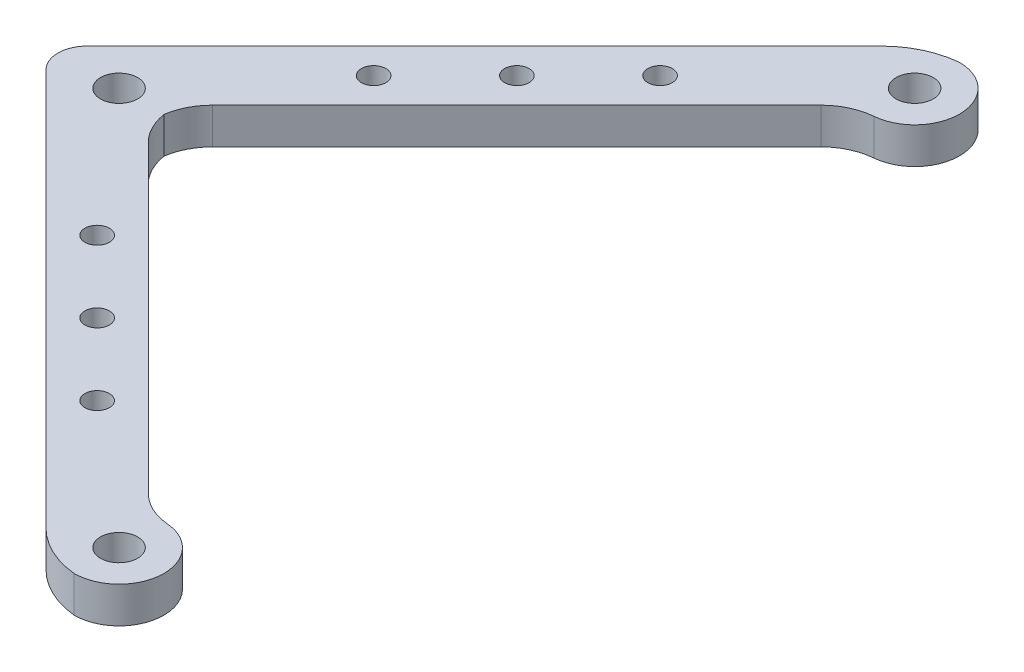
ISO-10303-21;
HEADER;
FILE_DESCRIPTION(('STEP AP214'),'2;1');
FILE_NAME('part.step','',(''),(''),'','','');
FILE_SCHEMA(('AUTOMOTIVE_DESIGN { 1 0 10303 214 1 1 1 1 }'));
ENDSEC;
DATA;
#1=APPLICATION_CONTEXT('core data for automotive mechanical design processes');
#2=APPLICATION_PROTOCOL_DEFINITION('international standard','automotive_design',2000,#1);
#3=PRODUCT_CONTEXT('',#1,'mechanical');
#4=PRODUCT('Part','Part','',(#3));
#5=PRODUCT_RELATED_PRODUCT_CATEGORY('part','',(#4));
#6=PRODUCT_DEFINITION_FORMATION('','',#4);
#7=PRODUCT_DEFINITION_CONTEXT('part definition',#1,'design');
#8=PRODUCT_DEFINITION('design','',#6,#7);
#9=PRODUCT_DEFINITION_SHAPE('','',#8);
#10=(LENGTH_UNIT() NAMED_UNIT(*) SI_UNIT(.MILLI.,.METRE.));
#11=(NAMED_UNIT(*) PLANE_ANGLE_UNIT() SI_UNIT($,.RADIAN.));
#12=(NAMED_UNIT(*) SI_UNIT($,.STERADIAN.) SOLID_ANGLE_UNIT());
#13=UNCERTAINTY_MEASURE_WITH_UNIT(LENGTH_MEASURE(1.E-05),#10,'distance_accuracy_value','');
#14=(GEOMETRIC_REPRESENTATION_CONTEXT(3) GLOBAL_UNCERTAINTY_ASSIGNED_CONTEXT((#13)) GLOBAL_UNIT_ASSIGNED_CONTEXT((#10,
#11,#12)) REPRESENTATION_CONTEXT('',''));
#15=CARTESIAN_POINT('',(0.,0.,0.));
#16=DIRECTION('',(0.,0.,1.));
#17=DIRECTION('',(1.,0.,0.));
#18=AXIS2_PLACEMENT_3D('',#15,#16,#17);
#19=CARTESIAN_POINT('',(0.,6.35,64.7165690571304));
#20=DIRECTION('',(-0.707103580398965,0.,0.707109981959642));
#21=DIRECTION('',(0.707109981959642,0.,0.707103580398965));
#22=AXIS2_PLACEMENT_3D('',#19,#20,#21);
#23=PLANE('',#22);
#24=DIRECTION('',(-0.707109981959642,0.,-0.707103580398965));
#25=VECTOR('',#24,1.);
#26=CARTESIAN_POINT('',(0.,0.,64.7165690571304));
#27=LINE('',#26,#25);
#28=CARTESIAN_POINT('',(-5.65110143879546,0.,59.0655187785076));
#29=VERTEX_POINT('',#28);
#30=CARTESIAN_POINT('',(-59.0654086414636,0.,5.65169514266398));
#31=VERTEX_POINT('',#30);
#32=EDGE_CURVE('E168',#29,#31,#27,.T.);
#33=ORIENTED_EDGE('',*,*,#32,.T.);
#34=DIRECTION('',(0.,1.,0.));
#35=VECTOR('',#34,1.);
#36=CARTESIAN_POINT('',(-59.0654086414636,6.35,5.65169514266398));
#37=LINE('',#36,#35);
#38=CARTESIAN_POINT('',(-59.0654086414636,6.35,5.65169514266398));
#39=VERTEX_POINT('',#38);
#40=EDGE_CURVE('E199',#31,#39,#37,.T.);
#41=ORIENTED_EDGE('',*,*,#40,.T.);
#42=DIRECTION('',(-0.707109981959642,0.,-0.707103580398965));
#43=VECTOR('',#42,1.);
#44=CARTESIAN_POINT('',(0.,6.35,64.7165690571304));
#45=LINE('',#44,#43);
#46=CARTESIAN_POINT('',(-5.65110143879546,6.35,59.0655187785076));
#47=VERTEX_POINT('',#46);
#48=EDGE_CURVE('E172',#47,#39,#45,.T.);
#49=ORIENTED_EDGE('',*,*,#48,.F.);
#50=DIRECTION('',(0.,1.,0.));
#51=VECTOR('',#50,1.);
#52=CARTESIAN_POINT('',(-5.65110143879546,6.35,59.0655187785076));
#53=LINE('',#52,#51);
#54=EDGE_CURVE('E196',#47,#29,#53,.F.);
#55=ORIENTED_EDGE('',*,*,#54,.T.);
#56=EDGE_LOOP('',(#33,#41,#49,#55));
#57=FACE_BOUND('',#56,.T.);
#58=ADVANCED_FACE('F38',(#57),#23,.F.);
#59=CARTESIAN_POINT('',(-82.6777484926492,6.35,0.));
#60=DIRECTION('',(0.707103580398965,0.,-0.707109981959641));
#61=DIRECTION('',(-0.707109981959641,0.,-0.707103580398965));
#62=AXIS2_PLACEMENT_3D('',#59,#60,#61);
#63=PLANE('',#62);
#64=DIRECTION('',(0.707109981959641,0.,0.707103580398965));
#65=VECTOR('',#64,1.);
#66=CARTESIAN_POINT('',(-82.6777484926492,6.35,0.));
#67=LINE('',#66,#65);
#68=CARTESIAN_POINT('',(-79.0855972640716,6.35,3.59211870835497));
#69=VERTEX_POINT('',#68);
#70=CARTESIAN_POINT('',(-9.34982610925561,6.35,73.3272585359634));
#71=VERTEX_POINT('',#70);
#72=EDGE_CURVE('E175',#69,#71,#67,.T.);
#73=ORIENTED_EDGE('',*,*,#72,.F.);
#74=DIRECTION('',(0.,-1.,0.));
#75=VECTOR('',#74,1.);
#76=CARTESIAN_POINT('',(-79.0855972640716,0.,3.59211870835497));
#77=LINE('',#76,#75);
#78=CARTESIAN_POINT('',(-79.0855972640716,0.,3.59211870835497));
#79=VERTEX_POINT('',#78);
#80=EDGE_CURVE('E226',#69,#79,#77,.T.);
#81=ORIENTED_EDGE('',*,*,#80,.T.);
#82=DIRECTION('',(0.707109981959641,0.,0.707103580398965));
#83=VECTOR('',#82,1.);
#84=CARTESIAN_POINT('',(-82.6777484926492,0.,0.));
#85=LINE('',#84,#83);
#86=CARTESIAN_POINT('',(-9.34982610925562,0.,73.3272585359634));
#87=VERTEX_POINT('',#86);
#88=EDGE_CURVE('E176',#79,#87,#85,.T.);
#89=ORIENTED_EDGE('',*,*,#88,.T.);
#90=DIRECTION('',(0.,1.,0.));
#91=VECTOR('',#90,1.);
#92=CARTESIAN_POINT('',(-9.34982610925562,6.35,73.3272585359634));
#93=LINE('',#92,#91);
#94=EDGE_CURVE('E138',#87,#71,#93,.T.);
#95=ORIENTED_EDGE('',*,*,#94,.T.);
#96=EDGE_LOOP('',(#73,#81,#89,#95));
#97=FACE_BOUND('',#96,.T.);
#98=ADVANCED_FACE('F236',(#97),#63,.F.);
#99=CARTESIAN_POINT('',(0.,6.35,0.));
#100=DIRECTION('',(0.,1.,0.));
#101=DIRECTION('',(0.,0.,1.));
#102=AXIS2_PLACEMENT_3D('',#99,#100,#101);
#103=PLANE('',#102);
#104=CARTESIAN_POINT('',(-24.2764079412943,6.35,-49.4207101840532));
#105=DIRECTION('',(0.,-1.,0.));
#106=DIRECTION('',(0.,0.,-1.));
#107=AXIS2_PLACEMENT_3D('',#104,#105,#106);
#108=CIRCLE('',#107,2.15265);
#109=CARTESIAN_POINT('',(-24.2764079412943,6.35,-51.5733601840532));
#110=VERTEX_POINT('',#109);
#111=EDGE_CURVE('E230',#110,#110,#108,.T.);
#112=ORIENTED_EDGE('',*,*,#111,.T.);
#113=EDGE_LOOP('',(#112));
#114=FACE_BOUND('',#113,.T.);
#115=CARTESIAN_POINT('',(-49.421125080288,6.35,-24.2759930450596));
#116=DIRECTION('',(0.,-1.,0.));
#117=DIRECTION('',(0.,0.,-1.));
#118=AXIS2_PLACEMENT_3D('',#115,#116,#117);
#119=CIRCLE('',#118,2.15265);
#120=CARTESIAN_POINT('',(-49.421125080288,6.35,-26.4286430450595));
#121=VERTEX_POINT('',#120);
#122=EDGE_CURVE('E395',#121,#121,#119,.T.);
#123=ORIENTED_EDGE('',*,*,#122,.T.);
#124=EDGE_LOOP('',(#123));
#125=FACE_BOUND('',#124,.T.);
#126=CARTESIAN_POINT('',(-36.8487665107912,6.35,-36.8483516145564));
#127=DIRECTION('',(0.,-1.,0.));
#128=DIRECTION('',(0.,0.,-1.));
#129=AXIS2_PLACEMENT_3D('',#126,#127,#128);
#130=CIRCLE('',#129,2.15265);
#131=CARTESIAN_POINT('',(-36.8487665107912,6.35,-39.0010016145564));
#132=VERTEX_POINT('',#131);
#133=EDGE_CURVE('E388',#132,#132,#130,.T.);
#134=ORIENTED_EDGE('',*,*,#133,.T.);
#135=EDGE_LOOP('',(#134));
#136=FACE_BOUND('',#135,.T.);
#137=CARTESIAN_POINT('',(-24.2764079412943,6.35,49.4207101840532));
#138=DIRECTION('',(0.,1.,0.));
#139=DIRECTION('',(0.,0.,1.));
#140=AXIS2_PLACEMENT_3D('',#137,#138,#139);
#141=CIRCLE('',#140,2.15265);
#142=CARTESIAN_POINT('',(-24.2764079412943,6.35,51.5733601840532));
#143=VERTEX_POINT('',#142);
#144=EDGE_CURVE('E380',#143,#143,#141,.T.);
#145=ORIENTED_EDGE('',*,*,#144,.F.);
#146=EDGE_LOOP('',(#145));
#147=FACE_BOUND('',#146,.T.);
#148=CARTESIAN_POINT('',(-49.421125080288,6.35,24.2759930450596));
#149=DIRECTION('',(0.,1.,0.));
#150=DIRECTION('',(0.,0.,1.));
#151=AXIS2_PLACEMENT_3D('',#148,#149,#150);
#152=CIRCLE('',#151,2.15265);
#153=CARTESIAN_POINT('',(-49.421125080288,6.35,26.4286430450595));
#154=VERTEX_POINT('',#153);
#155=EDGE_CURVE('E384',#154,#154,#152,.T.);
#156=ORIENTED_EDGE('',*,*,#155,.F.);
#157=EDGE_LOOP('',(#156));
#158=FACE_BOUND('',#157,.T.);
#159=CARTESIAN_POINT('',(-36.8487665107912,6.35,36.8483516145564));
#160=DIRECTION('',(0.,1.,0.));
#161=DIRECTION('',(0.,0.,1.));
#162=AXIS2_PLACEMENT_3D('',#159,#160,#161);
#163=CIRCLE('',#162,2.15265);
#164=CARTESIAN_POINT('',(-36.8487665107912,6.35,39.0010016145564));
#165=VERTEX_POINT('',#164);
#166=EDGE_CURVE('E376',#165,#165,#163,.T.);
#167=ORIENTED_EDGE('',*,*,#166,.F.);
#168=EDGE_LOOP('',(#167));
#169=FACE_BOUND('',#168,.T.);
#170=CARTESIAN_POINT('',(0.,6.35,-69.85));
#171=DIRECTION('',(0.,1.,0.));
#172=DIRECTION('',(0.,0.,1.));
#173=AXIS2_PLACEMENT_3D('',#170,#171,#172);
#174=CIRCLE('',#173,3.26389999999999);
#175=CARTESIAN_POINT('',(0.,6.35,-66.5861));
#176=VERTEX_POINT('',#175);
#177=EDGE_CURVE('E185',#176,#176,#174,.T.);
#178=ORIENTED_EDGE('',*,*,#177,.F.);
#179=EDGE_LOOP('',(#178));
#180=FACE_BOUND('',#179,.T.);
#181=CARTESIAN_POINT('',(-69.85,6.35,-2.24334252615332E-13));
#182=DIRECTION('',(0.,1.,0.));
#183=DIRECTION('',(0.,0.,1.));
#184=AXIS2_PLACEMENT_3D('',#181,#182,#183);
#185=CIRCLE('',#184,3.26389999999999);
#186=CARTESIAN_POINT('',(-69.85,6.35,3.26389999999976));
#187=VERTEX_POINT('',#186);
#188=EDGE_CURVE('E184',#187,#187,#185,.T.);
#189=ORIENTED_EDGE('',*,*,#188,.F.);
#190=EDGE_LOOP('',(#189));
#191=FACE_BOUND('',#190,.T.);
#192=DIRECTION('',(0.707109981959641,0.,-0.707103580398965));
#193=VECTOR('',#192,1.);
#194=CARTESIAN_POINT('',(-82.6777484926492,6.35,0.));
#195=LINE('',#194,#193);
#196=CARTESIAN_POINT('',(-79.0855972640716,6.35,-3.59211870835497));
#197=VERTEX_POINT('',#196);
#198=CARTESIAN_POINT('',(-9.34982610925561,6.35,-73.3272585359634));
#199=VERTEX_POINT('',#198);
#200=EDGE_CURVE('E162',#197,#199,#195,.T.);
#201=ORIENTED_EDGE('',*,*,#200,.F.);
#202=CARTESIAN_POINT('',(-75.4935110756448,6.35,0.));
#203=DIRECTION('',(0.,1.,0.));
#204=DIRECTION('',(0.,0.,1.));
#205=AXIS2_PLACEMENT_3D('',#202,#203,#204);
#206=CIRCLE('',#205,5.08);
#207=EDGE_CURVE('E11',#197,#69,#206,.T.);
#208=ORIENTED_EDGE('',*,*,#207,.T.);
#209=ORIENTED_EDGE('',*,*,#72,.T.);
#210=CARTESIAN_POINT('',(1.42643245602462,6.35,62.5509024108984));
#211=DIRECTION('',(0.,1.,0.));
#212=DIRECTION('',(0.,0.,1.));
#213=AXIS2_PLACEMENT_3D('',#210,#211,#212);
#214=CIRCLE('',#213,15.24);
#215=CARTESIAN_POINT('',(0.,6.35,77.724));
#216=VERTEX_POINT('',#215);
#217=EDGE_CURVE('E190',#71,#216,#214,.T.);
#218=ORIENTED_EDGE('',*,*,#217,.T.);
#219=CARTESIAN_POINT('',(0.,6.35,69.85));
#220=DIRECTION('',(0.,1.,0.));
#221=DIRECTION('',(0.,0.,1.));
#222=AXIS2_PLACEMENT_3D('',#219,#220,#221);
#223=CIRCLE('',#222,7.874);
#224=CARTESIAN_POINT('',(0.669369001123923,6.35,62.004503129799));
#225=VERTEX_POINT('',#224);
#226=EDGE_CURVE('E150',#216,#225,#223,.T.);
#227=ORIENTED_EDGE('',*,*,#226,.T.);
#228=CARTESIAN_POINT('',(1.53307093805802,6.35,51.8812813617976));
#229=DIRECTION('',(0.,1.,0.));
#230=DIRECTION('',(0.,0.,1.));
#231=AXIS2_PLACEMENT_3D('',#228,#229,#230);
#232=CIRCLE('',#231,10.16);
#233=EDGE_CURVE('E224',#225,#47,#232,.F.);
#234=ORIENTED_EDGE('',*,*,#233,.T.);
#235=ORIENTED_EDGE('',*,*,#48,.T.);
#236=CARTESIAN_POINT('',(-51.8812362646101,6.35,-1.53254227404598));
#237=DIRECTION('',(0.,1.,0.));
#238=DIRECTION('',(0.,0.,1.));
#239=AXIS2_PLACEMENT_3D('',#236,#237,#238);
#240=CIRCLE('',#239,10.16);
#241=CARTESIAN_POINT('',(-61.924986270373,6.35,-1.15792792021452E-13));
#242=VERTEX_POINT('',#241);
#243=EDGE_CURVE('E211',#39,#242,#240,.F.);
#244=ORIENTED_EDGE('',*,*,#243,.T.);
#245=CARTESIAN_POINT('',(-51.8812362646102,6.35,1.53254227404602));
#246=DIRECTION('',(0.,1.,0.));
#247=DIRECTION('',(0.,0.,1.));
#248=AXIS2_PLACEMENT_3D('',#245,#246,#247);
#249=CIRCLE('',#248,10.16);
#250=CARTESIAN_POINT('',(-59.0654086414636,6.35,-5.65169514266393));
#251=VERTEX_POINT('',#250);
#252=EDGE_CURVE('E215',#242,#251,#249,.F.);
#253=ORIENTED_EDGE('',*,*,#252,.T.);
#254=DIRECTION('',(-0.707109981959642,0.,0.707103580398965));
#255=VECTOR('',#254,1.);
#256=CARTESIAN_POINT('',(0.,6.35,-64.7165690571304));
#257=LINE('',#256,#255);
#258=CARTESIAN_POINT('',(-5.65110143879546,6.35,-59.0655187785076));
#259=VERTEX_POINT('',#258);
#260=EDGE_CURVE('E164',#259,#251,#257,.T.);
#261=ORIENTED_EDGE('',*,*,#260,.F.);
#262=CARTESIAN_POINT('',(1.53307093805802,6.35,-51.8812813617976));
#263=DIRECTION('',(0.,1.,0.));
#264=DIRECTION('',(0.,0.,1.));
#265=AXIS2_PLACEMENT_3D('',#262,#263,#264);
#266=CIRCLE('',#265,10.16);
#267=CARTESIAN_POINT('',(0.669369001123923,6.35,-62.004503129799));
#268=VERTEX_POINT('',#267);
#269=EDGE_CURVE('E221',#259,#268,#266,.F.);
#270=ORIENTED_EDGE('',*,*,#269,.T.);
#271=CARTESIAN_POINT('',(0.,6.35,-69.85));
#272=DIRECTION('',(0.,1.,0.));
#273=DIRECTION('',(0.,0.,-1.));
#274=AXIS2_PLACEMENT_3D('',#271,#272,#273);
#275=CIRCLE('',#274,7.874);
#276=CARTESIAN_POINT('',(0.,6.35,-77.724));
#277=VERTEX_POINT('',#276);
#278=EDGE_CURVE('E255',#268,#277,#275,.T.);
#279=ORIENTED_EDGE('',*,*,#278,.T.);
#280=CARTESIAN_POINT('',(1.42643245602462,6.35,-62.5509024108984));
#281=DIRECTION('',(0.,1.,0.));
#282=DIRECTION('',(0.,0.,1.));
#283=AXIS2_PLACEMENT_3D('',#280,#281,#282);
#284=CIRCLE('',#283,15.24);
#285=EDGE_CURVE('E192',#277,#199,#284,.T.);
#286=ORIENTED_EDGE('',*,*,#285,.T.);
#287=EDGE_LOOP('',(#201,#208,#209,#218,#227,#234,#235,#244,#253,#261,#270,#279,#286));
#288=FACE_BOUND('',#287,.T.);
#289=CARTESIAN_POINT('',(0.,6.35,69.85));
#290=DIRECTION('',(0.,1.,0.));
#291=DIRECTION('',(0.,0.,1.));
#292=AXIS2_PLACEMENT_3D('',#289,#290,#291);
#293=CIRCLE('',#292,3.26389999999999);
#294=CARTESIAN_POINT('',(0.,6.35,73.1139));
#295=VERTEX_POINT('',#294);
#296=EDGE_CURVE('E257',#295,#295,#293,.T.);
#297=ORIENTED_EDGE('',*,*,#296,.F.);
#298=EDGE_LOOP('',(#297));
#299=FACE_BOUND('',#298,.T.);
#300=ADVANCED_FACE('F240',(#114,#125,#136,#147,#158,#169,#180,#191,#288,#299),#103,.T.);
#301=CARTESIAN_POINT('',(0.,0.,0.));
#302=DIRECTION('',(0.,1.,0.));
#303=DIRECTION('',(0.,0.,1.));
#304=AXIS2_PLACEMENT_3D('',#301,#302,#303);
#305=PLANE('',#304);
#306=CARTESIAN_POINT('',(-24.2764079412943,0.,-49.4207101840532));
#307=DIRECTION('',(0.,-1.,0.));
#308=DIRECTION('',(0.,0.,-1.));
#309=AXIS2_PLACEMENT_3D('',#306,#307,#308);
#310=CIRCLE('',#309,2.15265);
#311=CARTESIAN_POINT('',(-24.2764079412943,0.,-51.5733601840532));
#312=VERTEX_POINT('',#311);
#313=EDGE_CURVE('E344',#312,#312,#310,.T.);
#314=ORIENTED_EDGE('',*,*,#313,.F.);
#315=EDGE_LOOP('',(#314));
#316=FACE_BOUND('',#315,.T.);
#317=CARTESIAN_POINT('',(-49.421125080288,0.,-24.2759930450596));
#318=DIRECTION('',(0.,-1.,0.));
#319=DIRECTION('',(0.,0.,-1.));
#320=AXIS2_PLACEMENT_3D('',#317,#318,#319);
#321=CIRCLE('',#320,2.15265);
#322=CARTESIAN_POINT('',(-49.421125080288,0.,-26.4286430450595));
#323=VERTEX_POINT('',#322);
#324=EDGE_CURVE('E348',#323,#323,#321,.T.);
#325=ORIENTED_EDGE('',*,*,#324,.F.);
#326=EDGE_LOOP('',(#325));
#327=FACE_BOUND('',#326,.T.);
#328=CARTESIAN_POINT('',(-36.8487665107912,0.,-36.8483516145564));
#329=DIRECTION('',(0.,-1.,0.));
#330=DIRECTION('',(0.,0.,-1.));
#331=AXIS2_PLACEMENT_3D('',#328,#329,#330);
#332=CIRCLE('',#331,2.15265);
#333=CARTESIAN_POINT('',(-36.8487665107912,0.,-39.0010016145564));
#334=VERTEX_POINT('',#333);
#335=EDGE_CURVE('E352',#334,#334,#332,.T.);
#336=ORIENTED_EDGE('',*,*,#335,.F.);
#337=EDGE_LOOP('',(#336));
#338=FACE_BOUND('',#337,.T.);
#339=CARTESIAN_POINT('',(-24.2764079412943,0.,49.4207101840532));
#340=DIRECTION('',(0.,1.,0.));
#341=DIRECTION('',(0.,0.,1.));
#342=AXIS2_PLACEMENT_3D('',#339,#340,#341);
#343=CIRCLE('',#342,2.15265);
#344=CARTESIAN_POINT('',(-24.2764079412943,0.,51.5733601840532));
#345=VERTEX_POINT('',#344);
#346=EDGE_CURVE('E356',#345,#345,#343,.T.);
#347=ORIENTED_EDGE('',*,*,#346,.T.);
#348=EDGE_LOOP('',(#347));
#349=FACE_BOUND('',#348,.T.);
#350=CARTESIAN_POINT('',(-49.421125080288,0.,24.2759930450596));
#351=DIRECTION('',(0.,1.,0.));
#352=DIRECTION('',(0.,0.,1.));
#353=AXIS2_PLACEMENT_3D('',#350,#351,#352);
#354=CIRCLE('',#353,2.15265);
#355=CARTESIAN_POINT('',(-49.421125080288,0.,26.4286430450595));
#356=VERTEX_POINT('',#355);
#357=EDGE_CURVE('E360',#356,#356,#354,.T.);
#358=ORIENTED_EDGE('',*,*,#357,.T.);
#359=EDGE_LOOP('',(#358));
#360=FACE_BOUND('',#359,.T.);
#361=CARTESIAN_POINT('',(-36.8487665107912,0.,36.8483516145564));
#362=DIRECTION('',(0.,1.,0.));
#363=DIRECTION('',(0.,0.,1.));
#364=AXIS2_PLACEMENT_3D('',#361,#362,#363);
#365=CIRCLE('',#364,2.15265);
#366=CARTESIAN_POINT('',(-36.8487665107912,0.,39.0010016145564));
#367=VERTEX_POINT('',#366);
#368=EDGE_CURVE('E364',#367,#367,#365,.T.);
#369=ORIENTED_EDGE('',*,*,#368,.T.);
#370=EDGE_LOOP('',(#369));
#371=FACE_BOUND('',#370,.T.);
#372=CARTESIAN_POINT('',(0.,0.,-69.85));
#373=DIRECTION('',(0.,1.,0.));
#374=DIRECTION('',(0.,0.,1.));
#375=AXIS2_PLACEMENT_3D('',#372,#373,#374);
#376=CIRCLE('',#375,3.26389999999999);
#377=CARTESIAN_POINT('',(0.,0.,-66.5861));
#378=VERTEX_POINT('',#377);
#379=EDGE_CURVE('E181',#378,#378,#376,.T.);
#380=ORIENTED_EDGE('',*,*,#379,.T.);
#381=EDGE_LOOP('',(#380));
#382=FACE_BOUND('',#381,.T.);
#383=CARTESIAN_POINT('',(-69.85,0.,-2.24334252615332E-13));
#384=DIRECTION('',(0.,1.,0.));
#385=DIRECTION('',(0.,0.,1.));
#386=AXIS2_PLACEMENT_3D('',#383,#384,#385);
#387=CIRCLE('',#386,3.26389999999999);
#388=CARTESIAN_POINT('',(-69.85,0.,3.26389999999976));
#389=VERTEX_POINT('',#388);
#390=EDGE_CURVE('E259',#389,#389,#387,.T.);
#391=ORIENTED_EDGE('',*,*,#390,.T.);
#392=EDGE_LOOP('',(#391));
#393=FACE_BOUND('',#392,.T.);
#394=CARTESIAN_POINT('',(0.,0.,69.85));
#395=DIRECTION('',(0.,1.,0.));
#396=DIRECTION('',(0.,0.,1.));
#397=AXIS2_PLACEMENT_3D('',#394,#395,#396);
#398=CIRCLE('',#397,3.26389999999999);
#399=CARTESIAN_POINT('',(0.,0.,73.1139));
#400=VERTEX_POINT('',#399);
#401=EDGE_CURVE('E157',#400,#400,#398,.T.);
#402=ORIENTED_EDGE('',*,*,#401,.T.);
#403=EDGE_LOOP('',(#402));
#404=FACE_BOUND('',#403,.T.);
#405=ORIENTED_EDGE('',*,*,#88,.F.);
#406=CARTESIAN_POINT('',(-75.4935110756448,0.,0.));
#407=DIRECTION('',(0.,1.,0.));
#408=DIRECTION('',(0.,0.,1.));
#409=AXIS2_PLACEMENT_3D('',#406,#407,#408);
#410=CIRCLE('',#409,5.08);
#411=CARTESIAN_POINT('',(-79.0855972640716,0.,-3.59211870835497));
#412=VERTEX_POINT('',#411);
#413=EDGE_CURVE('E60',#79,#412,#410,.F.);
#414=ORIENTED_EDGE('',*,*,#413,.T.);
#415=DIRECTION('',(0.707109981959641,0.,-0.707103580398965));
#416=VECTOR('',#415,1.);
#417=CARTESIAN_POINT('',(-82.6777484926492,0.,0.));
#418=LINE('',#417,#416);
#419=CARTESIAN_POINT('',(-9.34982610925561,0.,-73.3272585359634));
#420=VERTEX_POINT('',#419);
#421=EDGE_CURVE('E151',#412,#420,#418,.T.);
#422=ORIENTED_EDGE('',*,*,#421,.T.);
#423=CARTESIAN_POINT('',(1.42643245602462,0.,-62.5509024108984));
#424=DIRECTION('',(0.,1.,0.));
#425=DIRECTION('',(0.,0.,1.));
#426=AXIS2_PLACEMENT_3D('',#423,#424,#425);
#427=CIRCLE('',#426,15.24);
#428=CARTESIAN_POINT('',(0.,0.,-77.724));
#429=VERTEX_POINT('',#428);
#430=EDGE_CURVE('E140',#420,#429,#427,.F.);
#431=ORIENTED_EDGE('',*,*,#430,.T.);
#432=CARTESIAN_POINT('',(0.,0.,-69.85));
#433=DIRECTION('',(0.,1.,0.));
#434=DIRECTION('',(0.,0.,-1.));
#435=AXIS2_PLACEMENT_3D('',#432,#433,#434);
#436=CIRCLE('',#435,7.874);
#437=CARTESIAN_POINT('',(0.669369001123923,0.,-62.004503129799));
#438=VERTEX_POINT('',#437);
#439=EDGE_CURVE('E252',#438,#429,#436,.T.);
#440=ORIENTED_EDGE('',*,*,#439,.F.);
#441=CARTESIAN_POINT('',(1.53307093805802,0.,-51.8812813617976));
#442=DIRECTION('',(0.,1.,0.));
#443=DIRECTION('',(0.,0.,1.));
#444=AXIS2_PLACEMENT_3D('',#441,#442,#443);
#445=CIRCLE('',#444,10.16);
#446=CARTESIAN_POINT('',(-5.65110143879546,0.,-59.0655187785076));
#447=VERTEX_POINT('',#446);
#448=EDGE_CURVE('E219',#438,#447,#445,.T.);
#449=ORIENTED_EDGE('',*,*,#448,.T.);
#450=DIRECTION('',(-0.707109981959642,0.,0.707103580398965));
#451=VECTOR('',#450,1.);
#452=CARTESIAN_POINT('',(0.,0.,-64.7165690571304));
#453=LINE('',#452,#451);
#454=CARTESIAN_POINT('',(-59.0654086414636,0.,-5.65169514266393));
#455=VERTEX_POINT('',#454);
#456=EDGE_CURVE('E165',#447,#455,#453,.T.);
#457=ORIENTED_EDGE('',*,*,#456,.T.);
#458=CARTESIAN_POINT('',(-51.8812362646102,0.,1.53254227404602));
#459=DIRECTION('',(0.,1.,0.));
#460=DIRECTION('',(0.,0.,1.));
#461=AXIS2_PLACEMENT_3D('',#458,#459,#460);
#462=CIRCLE('',#461,10.16);
#463=CARTESIAN_POINT('',(-61.924986270373,0.,-1.15792792021452E-13));
#464=VERTEX_POINT('',#463);
#465=EDGE_CURVE('E217',#455,#464,#462,.T.);
#466=ORIENTED_EDGE('',*,*,#465,.T.);
#467=CARTESIAN_POINT('',(-51.8812362646101,0.,-1.53254227404598));
#468=DIRECTION('',(0.,1.,0.));
#469=DIRECTION('',(0.,0.,1.));
#470=AXIS2_PLACEMENT_3D('',#467,#468,#469);
#471=CIRCLE('',#470,10.16);
#472=EDGE_CURVE('E213',#464,#31,#471,.T.);
#473=ORIENTED_EDGE('',*,*,#472,.T.);
#474=ORIENTED_EDGE('',*,*,#32,.F.);
#475=CARTESIAN_POINT('',(1.53307093805802,0.,51.8812813617976));
#476=DIRECTION('',(0.,1.,0.));
#477=DIRECTION('',(0.,0.,1.));
#478=AXIS2_PLACEMENT_3D('',#475,#476,#477);
#479=CIRCLE('',#478,10.16);
#480=CARTESIAN_POINT('',(0.669369001123923,0.,62.004503129799));
#481=VERTEX_POINT('',#480);
#482=EDGE_CURVE('E155',#29,#481,#479,.T.);
#483=ORIENTED_EDGE('',*,*,#482,.T.);
#484=CARTESIAN_POINT('',(0.,0.,69.85));
#485=DIRECTION('',(0.,1.,0.));
#486=DIRECTION('',(0.,0.,1.));
#487=AXIS2_PLACEMENT_3D('',#484,#485,#486);
#488=CIRCLE('',#487,7.874);
#489=CARTESIAN_POINT('',(0.,0.,77.724));
#490=VERTEX_POINT('',#489);
#491=EDGE_CURVE('E147',#490,#481,#488,.T.);
#492=ORIENTED_EDGE('',*,*,#491,.F.);
#493=CARTESIAN_POINT('',(1.42643245602462,0.,62.5509024108984));
#494=DIRECTION('',(0.,1.,0.));
#495=DIRECTION('',(0.,0.,1.));
#496=AXIS2_PLACEMENT_3D('',#493,#494,#495);
#497=CIRCLE('',#496,15.24);
#498=EDGE_CURVE('E132',#490,#87,#497,.F.);
#499=ORIENTED_EDGE('',*,*,#498,.T.);
#500=EDGE_LOOP('',(#405,#414,#422,#431,#440,#449,#457,#466,#473,#474,#483,#492,#499));
#501=FACE_BOUND('',#500,.T.);
#502=ADVANCED_FACE('F153',(#316,#327,#338,#349,#360,#371,#382,#393,#404,#501),#305,.F.);
#503=CARTESIAN_POINT('',(-82.6777484926492,6.35,0.));
#504=DIRECTION('',(-0.707103580398965,0.,-0.707109981959641));
#505=DIRECTION('',(-0.707109981959641,0.,0.707103580398965));
#506=AXIS2_PLACEMENT_3D('',#503,#504,#505);
#507=PLANE('',#506);
#508=ORIENTED_EDGE('',*,*,#421,.F.);
#509=DIRECTION('',(0.,-1.,0.));
#510=VECTOR('',#509,1.);
#511=CARTESIAN_POINT('',(-79.0855972640716,6.35,-3.59211870835497));
#512=LINE('',#511,#510);
#513=EDGE_CURVE('E46',#412,#197,#512,.F.);
#514=ORIENTED_EDGE('',*,*,#513,.T.);
#515=ORIENTED_EDGE('',*,*,#200,.T.);
#516=DIRECTION('',(0.,-1.,0.));
#517=VECTOR('',#516,1.);
#518=CARTESIAN_POINT('',(-9.34982610925561,0.,-73.3272585359634));
#519=LINE('',#518,#517);
#520=EDGE_CURVE('E141',#199,#420,#519,.T.);
#521=ORIENTED_EDGE('',*,*,#520,.T.);
#522=EDGE_LOOP('',(#508,#514,#515,#521));
#523=FACE_BOUND('',#522,.T.);
#524=ADVANCED_FACE('F244',(#523),#507,.T.);
#525=CARTESIAN_POINT('',(0.,6.35,-64.7165690571304));
#526=DIRECTION('',(0.707103580398965,0.,0.707109981959642));
#527=DIRECTION('',(0.707109981959642,0.,-0.707103580398965));
#528=AXIS2_PLACEMENT_3D('',#525,#526,#527);
#529=PLANE('',#528);
#530=ORIENTED_EDGE('',*,*,#260,.T.);
#531=DIRECTION('',(0.,-1.,0.));
#532=VECTOR('',#531,1.);
#533=CARTESIAN_POINT('',(-59.0654086414636,0.,-5.65169514266393));
#534=LINE('',#533,#532);
#535=EDGE_CURVE('E204',#251,#455,#534,.T.);
#536=ORIENTED_EDGE('',*,*,#535,.T.);
#537=ORIENTED_EDGE('',*,*,#456,.F.);
#538=DIRECTION('',(0.,-1.,0.));
#539=VECTOR('',#538,1.);
#540=CARTESIAN_POINT('',(-5.65110143879546,6.35,-59.0655187785076));
#541=LINE('',#540,#539);
#542=EDGE_CURVE('E202',#447,#259,#541,.F.);
#543=ORIENTED_EDGE('',*,*,#542,.T.);
#544=EDGE_LOOP('',(#530,#536,#537,#543));
#545=FACE_BOUND('',#544,.T.);
#546=ADVANCED_FACE('F280',(#545),#529,.T.);
#547=CARTESIAN_POINT('',(0.,0.,69.85));
#548=DIRECTION('',(0.,1.,0.));
#549=DIRECTION('',(0.,0.,1.));
#550=AXIS2_PLACEMENT_3D('',#547,#548,#549);
#551=CYLINDRICAL_SURFACE('',#550,7.874);
#552=ORIENTED_EDGE('',*,*,#491,.T.);
#553=DIRECTION('',(0.,1.,0.));
#554=VECTOR('',#553,1.);
#555=CARTESIAN_POINT('',(0.669369001123923,0.,62.004503129799));
#556=LINE('',#555,#554);
#557=EDGE_CURVE('E209',#481,#225,#556,.T.);
#558=ORIENTED_EDGE('',*,*,#557,.T.);
#559=ORIENTED_EDGE('',*,*,#226,.F.);
#560=DIRECTION('',(0.,1.,0.));
#561=VECTOR('',#560,1.);
#562=CARTESIAN_POINT('',(0.,0.,77.724));
#563=LINE('',#562,#561);
#564=EDGE_CURVE('E136',#490,#216,#563,.T.);
#565=ORIENTED_EDGE('',*,*,#564,.F.);
#566=EDGE_LOOP('',(#552,#558,#559,#565));
#567=FACE_BOUND('',#566,.T.);
#568=ADVANCED_FACE('F146',(#567),#551,.T.);
#569=CARTESIAN_POINT('',(0.,6.35,69.85));
#570=DIRECTION('',(0.,1.,0.));
#571=DIRECTION('',(0.,0.,1.));
#572=AXIS2_PLACEMENT_3D('',#569,#570,#571);
#573=CYLINDRICAL_SURFACE('',#572,3.26389999999999);
#574=ORIENTED_EDGE('',*,*,#296,.T.);
#575=EDGE_LOOP('',(#574));
#576=FACE_BOUND('',#575,.T.);
#577=ORIENTED_EDGE('',*,*,#401,.F.);
#578=EDGE_LOOP('',(#577));
#579=FACE_BOUND('',#578,.T.);
#580=ADVANCED_FACE('F270',(#576,#579),#573,.F.);
#581=CARTESIAN_POINT('',(0.,0.,-69.85));
#582=DIRECTION('',(0.,1.,0.));
#583=DIRECTION('',(0.,0.,1.));
#584=AXIS2_PLACEMENT_3D('',#581,#582,#583);
#585=CYLINDRICAL_SURFACE('',#584,7.874);
#586=ORIENTED_EDGE('',*,*,#278,.F.);
#587=DIRECTION('',(0.,1.,0.));
#588=VECTOR('',#587,1.);
#589=CARTESIAN_POINT('',(0.669369001123923,0.,-62.004503129799));
#590=LINE('',#589,#588);
#591=EDGE_CURVE('E206',#268,#438,#590,.F.);
#592=ORIENTED_EDGE('',*,*,#591,.T.);
#593=ORIENTED_EDGE('',*,*,#439,.T.);
#594=DIRECTION('',(0.,1.,0.));
#595=VECTOR('',#594,1.);
#596=CARTESIAN_POINT('',(0.,0.,-77.724));
#597=LINE('',#596,#595);
#598=EDGE_CURVE('E250',#429,#277,#597,.T.);
#599=ORIENTED_EDGE('',*,*,#598,.T.);
#600=EDGE_LOOP('',(#586,#592,#593,#599));
#601=FACE_BOUND('',#600,.T.);
#602=ADVANCED_FACE('F272',(#601),#585,.T.);
#603=CARTESIAN_POINT('',(-69.85,6.35,-2.24334252615332E-13));
#604=DIRECTION('',(0.,1.,0.));
#605=DIRECTION('',(0.,0.,1.));
#606=AXIS2_PLACEMENT_3D('',#603,#604,#605);
#607=CYLINDRICAL_SURFACE('',#606,3.26389999999999);
#608=ORIENTED_EDGE('',*,*,#188,.T.);
#609=EDGE_LOOP('',(#608));
#610=FACE_BOUND('',#609,.T.);
#611=ORIENTED_EDGE('',*,*,#390,.F.);
#612=EDGE_LOOP('',(#611));
#613=FACE_BOUND('',#612,.T.);
#614=ADVANCED_FACE('F278',(#610,#613),#607,.F.);
#615=CARTESIAN_POINT('',(0.,6.35,-69.85));
#616=DIRECTION('',(0.,1.,0.));
#617=DIRECTION('',(0.,0.,1.));
#618=AXIS2_PLACEMENT_3D('',#615,#616,#617);
#619=CYLINDRICAL_SURFACE('',#618,3.26389999999999);
#620=ORIENTED_EDGE('',*,*,#177,.T.);
#621=EDGE_LOOP('',(#620));
#622=FACE_BOUND('',#621,.T.);
#623=ORIENTED_EDGE('',*,*,#379,.F.);
#624=EDGE_LOOP('',(#623));
#625=FACE_BOUND('',#624,.T.);
#626=ADVANCED_FACE('F418',(#622,#625),#619,.F.);
#627=CARTESIAN_POINT('',(-36.8487665107912,0.,36.8483516145564));
#628=DIRECTION('',(0.,1.,0.));
#629=DIRECTION('',(0.,0.,1.));
#630=AXIS2_PLACEMENT_3D('',#627,#628,#629);
#631=CYLINDRICAL_SURFACE('',#630,2.15265);
#632=ORIENTED_EDGE('',*,*,#368,.F.);
#633=EDGE_LOOP('',(#632));
#634=FACE_BOUND('',#633,.T.);
#635=ORIENTED_EDGE('',*,*,#166,.T.);
#636=EDGE_LOOP('',(#635));
#637=FACE_BOUND('',#636,.T.);
#638=ADVANCED_FACE('F421',(#634,#637),#631,.F.);
#639=CARTESIAN_POINT('',(-49.421125080288,0.,24.2759930450596));
#640=DIRECTION('',(0.,1.,0.));
#641=DIRECTION('',(0.,0.,1.));
#642=AXIS2_PLACEMENT_3D('',#639,#640,#641);
#643=CYLINDRICAL_SURFACE('',#642,2.15265);
#644=ORIENTED_EDGE('',*,*,#357,.F.);
#645=EDGE_LOOP('',(#644));
#646=FACE_BOUND('',#645,.T.);
#647=ORIENTED_EDGE('',*,*,#155,.T.);
#648=EDGE_LOOP('',(#647));
#649=FACE_BOUND('',#648,.T.);
#650=ADVANCED_FACE('F427',(#646,#649),#643,.F.);
#651=CARTESIAN_POINT('',(-24.2764079412943,0.,49.4207101840532));
#652=DIRECTION('',(0.,1.,0.));
#653=DIRECTION('',(0.,0.,1.));
#654=AXIS2_PLACEMENT_3D('',#651,#652,#653);
#655=CYLINDRICAL_SURFACE('',#654,2.15265);
#656=ORIENTED_EDGE('',*,*,#346,.F.);
#657=EDGE_LOOP('',(#656));
#658=FACE_BOUND('',#657,.T.);
#659=ORIENTED_EDGE('',*,*,#144,.T.);
#660=EDGE_LOOP('',(#659));
#661=FACE_BOUND('',#660,.T.);
#662=ADVANCED_FACE('F432',(#658,#661),#655,.F.);
#663=CARTESIAN_POINT('',(-36.8487665107912,0.,-36.8483516145564));
#664=DIRECTION('',(0.,1.,0.));
#665=DIRECTION('',(0.,0.,1.));
#666=AXIS2_PLACEMENT_3D('',#663,#664,#665);
#667=CYLINDRICAL_SURFACE('',#666,2.15265);
#668=ORIENTED_EDGE('',*,*,#335,.T.);
#669=EDGE_LOOP('',(#668));
#670=FACE_BOUND('',#669,.T.);
#671=ORIENTED_EDGE('',*,*,#133,.F.);
#672=EDGE_LOOP('',(#671));
#673=FACE_BOUND('',#672,.T.);
#674=ADVANCED_FACE('F402',(#670,#673),#667,.F.);
#675=CARTESIAN_POINT('',(-49.421125080288,0.,-24.2759930450596));
#676=DIRECTION('',(0.,1.,0.));
#677=DIRECTION('',(0.,0.,1.));
#678=AXIS2_PLACEMENT_3D('',#675,#676,#677);
#679=CYLINDRICAL_SURFACE('',#678,2.15265);
#680=ORIENTED_EDGE('',*,*,#324,.T.);
#681=EDGE_LOOP('',(#680));
#682=FACE_BOUND('',#681,.T.);
#683=ORIENTED_EDGE('',*,*,#122,.F.);
#684=EDGE_LOOP('',(#683));
#685=FACE_BOUND('',#684,.T.);
#686=ADVANCED_FACE('F399',(#682,#685),#679,.F.);
#687=CARTESIAN_POINT('',(-24.2764079412943,0.,-49.4207101840532));
#688=DIRECTION('',(0.,1.,0.));
#689=DIRECTION('',(0.,0.,1.));
#690=AXIS2_PLACEMENT_3D('',#687,#688,#689);
#691=CYLINDRICAL_SURFACE('',#690,2.15265);
#692=ORIENTED_EDGE('',*,*,#313,.T.);
#693=EDGE_LOOP('',(#692));
#694=FACE_BOUND('',#693,.T.);
#695=ORIENTED_EDGE('',*,*,#111,.F.);
#696=EDGE_LOOP('',(#695));
#697=FACE_BOUND('',#696,.T.);
#698=ADVANCED_FACE('F293',(#694,#697),#691,.F.);
#699=CARTESIAN_POINT('',(1.42643245602462,0.,-62.5509024108984));
#700=DIRECTION('',(0.,1.,0.));
#701=DIRECTION('',(0.,0.,1.));
#702=AXIS2_PLACEMENT_3D('',#699,#700,#701);
#703=CYLINDRICAL_SURFACE('',#702,15.24);
#704=ORIENTED_EDGE('',*,*,#285,.F.);
#705=ORIENTED_EDGE('',*,*,#598,.F.);
#706=ORIENTED_EDGE('',*,*,#430,.F.);
#707=ORIENTED_EDGE('',*,*,#520,.F.);
#708=EDGE_LOOP('',(#704,#705,#706,#707));
#709=FACE_BOUND('',#708,.T.);
#710=ADVANCED_FACE('F247',(#709),#703,.T.);
#711=CARTESIAN_POINT('',(1.42643245602462,0.,62.5509024108984));
#712=DIRECTION('',(0.,1.,0.));
#713=DIRECTION('',(0.,0.,1.));
#714=AXIS2_PLACEMENT_3D('',#711,#712,#713);
#715=CYLINDRICAL_SURFACE('',#714,15.24);
#716=ORIENTED_EDGE('',*,*,#217,.F.);
#717=ORIENTED_EDGE('',*,*,#94,.F.);
#718=ORIENTED_EDGE('',*,*,#498,.F.);
#719=ORIENTED_EDGE('',*,*,#564,.T.);
#720=EDGE_LOOP('',(#716,#717,#718,#719));
#721=FACE_BOUND('',#720,.T.);
#722=ADVANCED_FACE('F135',(#721),#715,.T.);
#723=CARTESIAN_POINT('',(-51.8812362646102,0.,1.53254227404602));
#724=DIRECTION('',(0.,1.,0.));
#725=DIRECTION('',(0.,0.,1.));
#726=AXIS2_PLACEMENT_3D('',#723,#724,#725);
#727=CYLINDRICAL_SURFACE('',#726,10.16);
#728=DIRECTION('',(0.,1.,0.));
#729=VECTOR('',#728,1.);
#730=CARTESIAN_POINT('',(-61.924986270373,3.175,-1.16443313324943E-13));
#731=LINE('',#730,#729);
#732=EDGE_CURVE('E227',#464,#242,#731,.T.);
#733=ORIENTED_EDGE('',*,*,#732,.F.);
#734=ORIENTED_EDGE('',*,*,#465,.F.);
#735=ORIENTED_EDGE('',*,*,#535,.F.);
#736=ORIENTED_EDGE('',*,*,#252,.F.);
#737=EDGE_LOOP('',(#733,#734,#735,#736));
#738=FACE_BOUND('',#737,.T.);
#739=ADVANCED_FACE('F296',(#738),#727,.F.);
#740=CARTESIAN_POINT('',(-51.8812362646101,0.,-1.53254227404598));
#741=DIRECTION('',(0.,1.,0.));
#742=DIRECTION('',(0.,0.,1.));
#743=AXIS2_PLACEMENT_3D('',#740,#741,#742);
#744=CYLINDRICAL_SURFACE('',#743,10.16);
#745=ORIENTED_EDGE('',*,*,#472,.F.);
#746=ORIENTED_EDGE('',*,*,#732,.T.);
#747=ORIENTED_EDGE('',*,*,#243,.F.);
#748=ORIENTED_EDGE('',*,*,#40,.F.);
#749=EDGE_LOOP('',(#745,#746,#747,#748));
#750=FACE_BOUND('',#749,.T.);
#751=ADVANCED_FACE('F297',(#750),#744,.F.);
#752=CARTESIAN_POINT('',(1.53307093805802,0.,-51.8812813617976));
#753=DIRECTION('',(0.,1.,0.));
#754=DIRECTION('',(0.,0.,1.));
#755=AXIS2_PLACEMENT_3D('',#752,#753,#754);
#756=CYLINDRICAL_SURFACE('',#755,10.16);
#757=ORIENTED_EDGE('',*,*,#269,.F.);
#758=ORIENTED_EDGE('',*,*,#542,.F.);
#759=ORIENTED_EDGE('',*,*,#448,.F.);
#760=ORIENTED_EDGE('',*,*,#591,.F.);
#761=EDGE_LOOP('',(#757,#758,#759,#760));
#762=FACE_BOUND('',#761,.T.);
#763=ADVANCED_FACE('F300',(#762),#756,.F.);
#764=CARTESIAN_POINT('',(1.53307093805802,0.,51.8812813617976));
#765=DIRECTION('',(0.,1.,0.));
#766=DIRECTION('',(0.,0.,1.));
#767=AXIS2_PLACEMENT_3D('',#764,#765,#766);
#768=CYLINDRICAL_SURFACE('',#767,10.16);
#769=ORIENTED_EDGE('',*,*,#233,.F.);
#770=ORIENTED_EDGE('',*,*,#557,.F.);
#771=ORIENTED_EDGE('',*,*,#482,.F.);
#772=ORIENTED_EDGE('',*,*,#54,.F.);
#773=EDGE_LOOP('',(#769,#770,#771,#772));
#774=FACE_BOUND('',#773,.T.);
#775=ADVANCED_FACE('F306',(#774),#768,.F.);
#776=CARTESIAN_POINT('',(-75.4935110756448,6.35,0.));
#777=DIRECTION('',(0.,1.,0.));
#778=DIRECTION('',(0.,0.,1.));
#779=AXIS2_PLACEMENT_3D('',#776,#777,#778);
#780=CYLINDRICAL_SURFACE('',#779,5.08);
#781=ORIENTED_EDGE('',*,*,#207,.F.);
#782=ORIENTED_EDGE('',*,*,#513,.F.);
#783=ORIENTED_EDGE('',*,*,#413,.F.);
#784=ORIENTED_EDGE('',*,*,#80,.F.);
#785=EDGE_LOOP('',(#781,#782,#783,#784));
#786=FACE_BOUND('',#785,.T.);
#787=ADVANCED_FACE('F40',(#786),#780,.T.);
#788=CLOSED_SHELL('',(#58,#98,#300,#502,#524,#546,#568,#580,#602,#614,#626,#638,#650,#662,#674,
#686,#698,#710,#722,#739,#751,#763,#775,#787));
#789=MANIFOLD_SOLID_BREP('B2',#788);
#790=ADVANCED_BREP_SHAPE_REPRESENTATION('',(#18,#789),#14);
#791=SHAPE_DEFINITION_REPRESENTATION(#9,#790);
ENDSEC;
END-ISO-10303-21;
